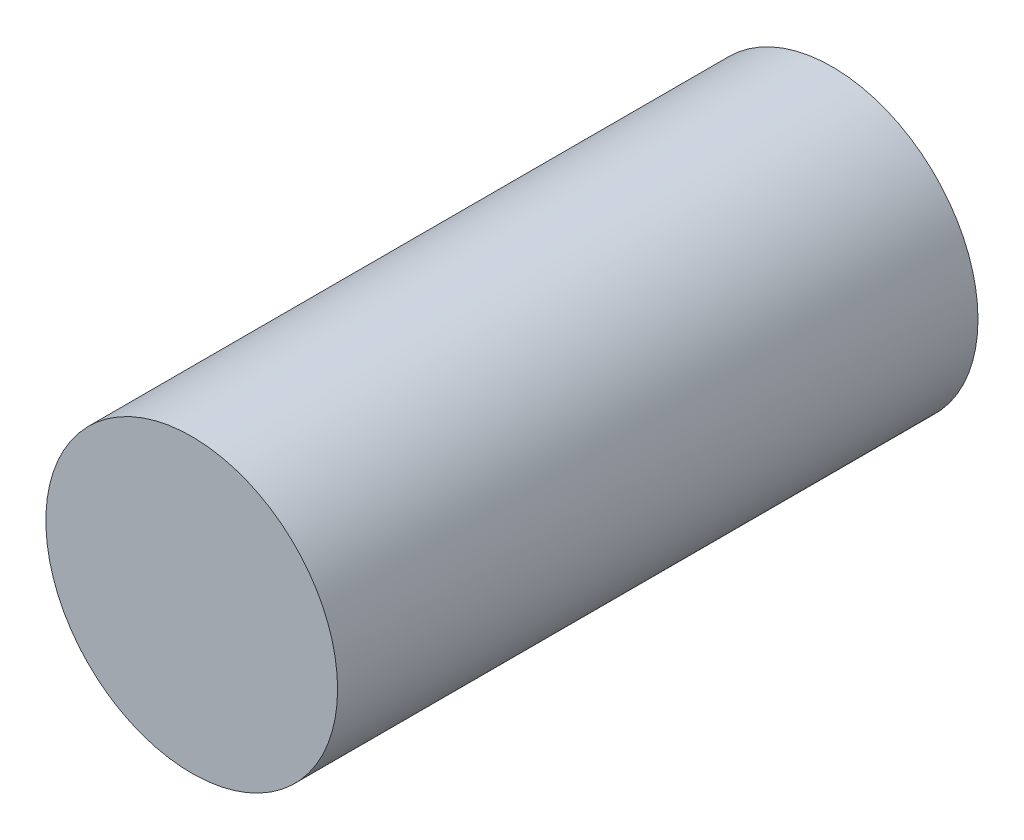
ISO-10303-21;
HEADER;
FILE_DESCRIPTION(('STEP AP214'),'2;1');
FILE_NAME('part.step','',(''),(''),'','','');
FILE_SCHEMA(('AUTOMOTIVE_DESIGN { 1 0 10303 214 1 1 1 1 }'));
ENDSEC;
DATA;
#1=APPLICATION_CONTEXT('core data for automotive mechanical design processes');
#2=APPLICATION_PROTOCOL_DEFINITION('international standard','automotive_design',2000,#1);
#3=PRODUCT_CONTEXT('',#1,'mechanical');
#4=PRODUCT('Part','Part','',(#3));
#5=PRODUCT_RELATED_PRODUCT_CATEGORY('part','',(#4));
#6=PRODUCT_DEFINITION_FORMATION('','',#4);
#7=PRODUCT_DEFINITION_CONTEXT('part definition',#1,'design');
#8=PRODUCT_DEFINITION('design','',#6,#7);
#9=PRODUCT_DEFINITION_SHAPE('','',#8);
#10=(LENGTH_UNIT() NAMED_UNIT(*) SI_UNIT(.MILLI.,.METRE.));
#11=(NAMED_UNIT(*) PLANE_ANGLE_UNIT() SI_UNIT($,.RADIAN.));
#12=(NAMED_UNIT(*) SI_UNIT($,.STERADIAN.) SOLID_ANGLE_UNIT());
#13=UNCERTAINTY_MEASURE_WITH_UNIT(LENGTH_MEASURE(1.E-05),#10,'distance_accuracy_value','');
#14=(GEOMETRIC_REPRESENTATION_CONTEXT(3) GLOBAL_UNCERTAINTY_ASSIGNED_CONTEXT((#13)) GLOBAL_UNIT_ASSIGNED_CONTEXT((#10,
#11,#12)) REPRESENTATION_CONTEXT('',''));
#15=CARTESIAN_POINT('',(0.,0.,0.));
#16=DIRECTION('',(0.,0.,1.));
#17=DIRECTION('',(1.,0.,0.));
#18=AXIS2_PLACEMENT_3D('',#15,#16,#17);
#19=CARTESIAN_POINT('',(-5.08,-1.27,0.1));
#20=DIRECTION('',(0.,0.,1.));
#21=DIRECTION('',(1.,0.,0.));
#22=AXIS2_PLACEMENT_3D('',#19,#20,#21);
#23=PLANE('',#22);
#24=CARTESIAN_POINT('',(-5.08,-1.27,0.1));
#25=DIRECTION('',(0.,0.,1.));
#26=DIRECTION('',(1.,0.,0.));
#27=AXIS2_PLACEMENT_3D('',#24,#25,#26);
#28=CIRCLE('',#27,0.41);
#29=CARTESIAN_POINT('',(-4.67,-1.27,0.1));
#30=VERTEX_POINT('',#29);
#31=EDGE_CURVE('E17',#30,#30,#28,.F.);
#32=ORIENTED_EDGE('',*,*,#31,.F.);
#33=EDGE_LOOP('',(#32));
#34=FACE_BOUND('',#33,.T.);
#35=ADVANCED_FACE('F14',(#34),#23,.T.);
#36=CARTESIAN_POINT('',(-5.08,-1.27,-1.7));
#37=DIRECTION('',(0.,0.,1.));
#38=DIRECTION('',(1.,0.,0.));
#39=AXIS2_PLACEMENT_3D('',#36,#37,#38);
#40=PLANE('',#39);
#41=CARTESIAN_POINT('',(-5.08,-1.27,-1.7));
#42=DIRECTION('',(0.,0.,1.));
#43=DIRECTION('',(1.,0.,0.));
#44=AXIS2_PLACEMENT_3D('',#41,#42,#43);
#45=CIRCLE('',#44,0.41);
#46=CARTESIAN_POINT('',(-4.67,-1.27,-1.7));
#47=VERTEX_POINT('',#46);
#48=EDGE_CURVE('E10',#47,#47,#45,.T.);
#49=ORIENTED_EDGE('',*,*,#48,.F.);
#50=EDGE_LOOP('',(#49));
#51=FACE_BOUND('',#50,.T.);
#52=ADVANCED_FACE('F29',(#51),#40,.F.);
#53=CARTESIAN_POINT('',(-5.08,-1.27,-1.7));
#54=DIRECTION('',(0.,0.,1.));
#55=DIRECTION('',(1.,0.,0.));
#56=AXIS2_PLACEMENT_3D('',#53,#54,#55);
#57=CYLINDRICAL_SURFACE('',#56,0.41);
#58=ORIENTED_EDGE('',*,*,#48,.T.);
#59=EDGE_LOOP('',(#58));
#60=FACE_BOUND('',#59,.T.);
#61=ORIENTED_EDGE('',*,*,#31,.T.);
#62=EDGE_LOOP('',(#61));
#63=FACE_BOUND('',#62,.T.);
#64=ADVANCED_FACE('F26',(#60,#63),#57,.T.);
#65=CLOSED_SHELL('',(#35,#52,#64));
#66=MANIFOLD_SOLID_BREP('B1',#65);
#67=ADVANCED_BREP_SHAPE_REPRESENTATION('',(#18,#66),#14);
#68=SHAPE_DEFINITION_REPRESENTATION(#9,#67);
ENDSEC;
END-ISO-10303-21;
